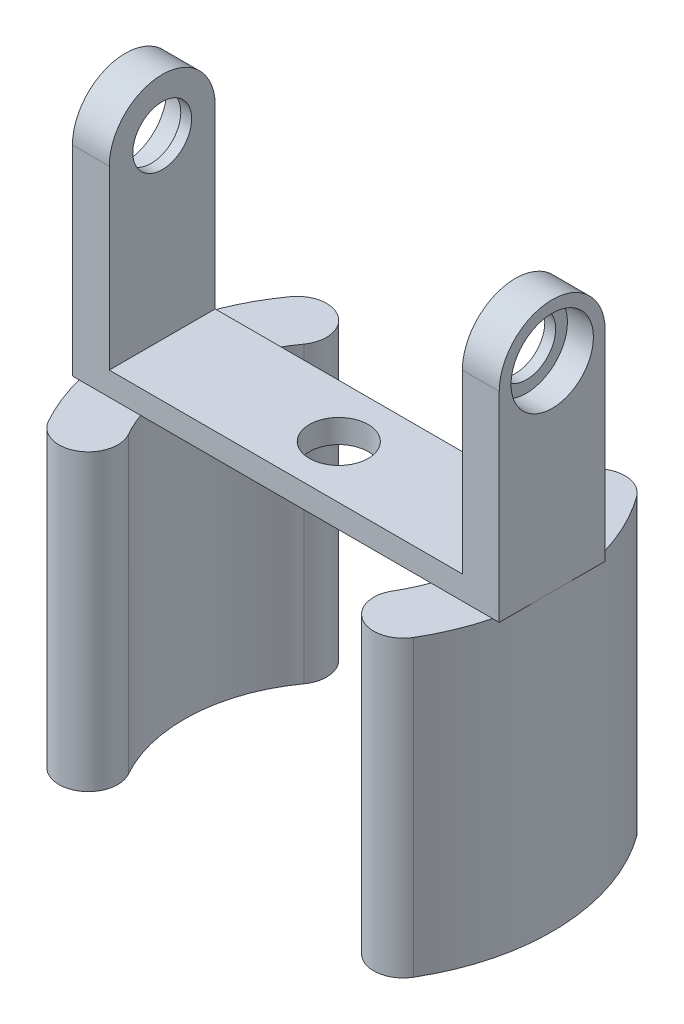
ISO-10303-21;
HEADER;
FILE_DESCRIPTION(('STEP AP214'),'2;1');
FILE_NAME('part.step','',(''),(''),'','','');
FILE_SCHEMA(('AUTOMOTIVE_DESIGN { 1 0 10303 214 1 1 1 1 }'));
ENDSEC;
DATA;
#1=APPLICATION_CONTEXT('core data for automotive mechanical design processes');
#2=APPLICATION_PROTOCOL_DEFINITION('international standard','automotive_design',2000,#1);
#3=PRODUCT_CONTEXT('',#1,'mechanical');
#4=PRODUCT('Part','Part','',(#3));
#5=PRODUCT_RELATED_PRODUCT_CATEGORY('part','',(#4));
#6=PRODUCT_DEFINITION_FORMATION('','',#4);
#7=PRODUCT_DEFINITION_CONTEXT('part definition',#1,'design');
#8=PRODUCT_DEFINITION('design','',#6,#7);
#9=PRODUCT_DEFINITION_SHAPE('','',#8);
#10=(LENGTH_UNIT() NAMED_UNIT(*) SI_UNIT(.MILLI.,.METRE.));
#11=(NAMED_UNIT(*) PLANE_ANGLE_UNIT() SI_UNIT($,.RADIAN.));
#12=(NAMED_UNIT(*) SI_UNIT($,.STERADIAN.) SOLID_ANGLE_UNIT());
#13=UNCERTAINTY_MEASURE_WITH_UNIT(LENGTH_MEASURE(1.E-05),#10,'distance_accuracy_value','');
#14=(GEOMETRIC_REPRESENTATION_CONTEXT(3) GLOBAL_UNCERTAINTY_ASSIGNED_CONTEXT((#13)) GLOBAL_UNIT_ASSIGNED_CONTEXT((#10,
#11,#12)) REPRESENTATION_CONTEXT('',''));
#15=CARTESIAN_POINT('',(0.,0.,0.));
#16=DIRECTION('',(0.,0.,1.));
#17=DIRECTION('',(1.,0.,0.));
#18=AXIS2_PLACEMENT_3D('',#15,#16,#17);
#19=CARTESIAN_POINT('',(0.,-34.,0.));
#20=DIRECTION('',(0.,1.,0.));
#21=DIRECTION('',(0.,0.,1.));
#22=AXIS2_PLACEMENT_3D('',#19,#20,#21);
#23=PLANE('',#22);
#24=CARTESIAN_POINT('',(-30.,-34.,0.));
#25=DIRECTION('',(0.,-1.,0.));
#26=DIRECTION('',(0.,0.,-1.));
#27=AXIS2_PLACEMENT_3D('',#24,#25,#26);
#28=CIRCLE('',#27,36.26);
#29=CARTESIAN_POINT('',(-65.125312809995,-34.,9.));
#30=VERTEX_POINT('',#29);
#31=CARTESIAN_POINT('',(-66.26,-34.,0.));
#32=VERTEX_POINT('',#31);
#33=EDGE_CURVE('E50',#30,#32,#28,.T.);
#34=ORIENTED_EDGE('',*,*,#33,.F.);
#35=DIRECTION('',(-1.,0.,0.));
#36=VECTOR('',#35,1.);
#37=CARTESIAN_POINT('',(6.26,-34.,9.));
#38=LINE('',#37,#36);
#39=CARTESIAN_POINT('',(-66.26,-34.,9.00000000000001));
#40=VERTEX_POINT('',#39);
#41=EDGE_CURVE('E299',#30,#40,#38,.T.);
#42=ORIENTED_EDGE('',*,*,#41,.T.);
#43=DIRECTION('',(0.,0.,1.));
#44=VECTOR('',#43,1.);
#45=CARTESIAN_POINT('',(-66.26,-34.,9.00000000000001));
#46=LINE('',#45,#44);
#47=EDGE_CURVE('E252',#32,#40,#46,.T.);
#48=ORIENTED_EDGE('',*,*,#47,.F.);
#49=EDGE_LOOP('',(#34,#42,#48));
#50=FACE_BOUND('',#49,.T.);
#51=ADVANCED_FACE('F32',(#50),#23,.F.);
#52=CARTESIAN_POINT('',(-65.125312809995,-34.,-9.));
#53=VERTEX_POINT('',#52);
#54=EDGE_CURVE('E386',#32,#53,#28,.T.);
#55=ORIENTED_EDGE('',*,*,#54,.F.);
#56=CARTESIAN_POINT('',(-66.26,-34.,-8.99999999999998));
#57=VERTEX_POINT('',#56);
#58=EDGE_CURVE('E255',#57,#32,#46,.T.);
#59=ORIENTED_EDGE('',*,*,#58,.F.);
#60=DIRECTION('',(1.,0.,0.));
#61=VECTOR('',#60,1.);
#62=CARTESIAN_POINT('',(6.26,-34.,-9.));
#63=LINE('',#62,#61);
#64=EDGE_CURVE('E306',#57,#53,#63,.T.);
#65=ORIENTED_EDGE('',*,*,#64,.T.);
#66=EDGE_LOOP('',(#55,#59,#65));
#67=FACE_BOUND('',#66,.T.);
#68=ADVANCED_FACE('F413',(#67),#23,.F.);
#69=CARTESIAN_POINT('',(-30.,-34.,0.));
#70=DIRECTION('',(0.,1.,0.));
#71=DIRECTION('',(0.,0.,1.));
#72=AXIS2_PLACEMENT_3D('',#69,#70,#71);
#73=CIRCLE('',#72,5.);
#74=CARTESIAN_POINT('',(-30.,-34.,5.00000000000001));
#75=VERTEX_POINT('',#74);
#76=EDGE_CURVE('E249',#75,#75,#73,.T.);
#77=ORIENTED_EDGE('',*,*,#76,.T.);
#78=EDGE_LOOP('',(#77));
#79=FACE_BOUND('',#78,.T.);
#80=CARTESIAN_POINT('',(-30.,-34.,0.));
#81=DIRECTION('',(0.,1.,0.));
#82=DIRECTION('',(0.,0.,-1.));
#83=AXIS2_PLACEMENT_3D('',#80,#81,#82);
#84=CIRCLE('',#83,26.26);
#85=CARTESIAN_POINT('',(-54.6695682978037,-34.,-8.99999999999999));
#86=VERTEX_POINT('',#85);
#87=CARTESIAN_POINT('',(-54.6695682978037,-34.,9.));
#88=VERTEX_POINT('',#87);
#89=EDGE_CURVE('E398',#86,#88,#84,.T.);
#90=ORIENTED_EDGE('',*,*,#89,.F.);
#91=CARTESIAN_POINT('',(-5.33043170219634,-34.,-9.));
#92=VERTEX_POINT('',#91);
#93=EDGE_CURVE('E310',#86,#92,#63,.T.);
#94=ORIENTED_EDGE('',*,*,#93,.T.);
#95=CARTESIAN_POINT('',(-30.,-34.,0.));
#96=DIRECTION('',(0.,1.,0.));
#97=DIRECTION('',(0.,0.,1.));
#98=AXIS2_PLACEMENT_3D('',#95,#96,#97);
#99=CIRCLE('',#98,26.26);
#100=CARTESIAN_POINT('',(-5.33043170219633,-34.,8.99999999999999));
#101=VERTEX_POINT('',#100);
#102=EDGE_CURVE('E234',#101,#92,#99,.T.);
#103=ORIENTED_EDGE('',*,*,#102,.F.);
#104=EDGE_CURVE('E414',#101,#88,#38,.T.);
#105=ORIENTED_EDGE('',*,*,#104,.T.);
#106=EDGE_LOOP('',(#90,#94,#103,#105));
#107=FACE_BOUND('',#106,.T.);
#108=ADVANCED_FACE('F450',(#79,#107),#23,.F.);
#109=CARTESIAN_POINT('',(-30.,-34.,0.));
#110=DIRECTION('',(0.,-1.,0.));
#111=DIRECTION('',(0.,0.,1.));
#112=AXIS2_PLACEMENT_3D('',#109,#110,#111);
#113=CIRCLE('',#112,36.26);
#114=CARTESIAN_POINT('',(5.12531280999501,-34.,-9.));
#115=VERTEX_POINT('',#114);
#116=CARTESIAN_POINT('',(6.25999999999999,-34.,0.));
#117=VERTEX_POINT('',#116);
#118=EDGE_CURVE('E11',#115,#117,#113,.T.);
#119=ORIENTED_EDGE('',*,*,#118,.F.);
#120=CARTESIAN_POINT('',(6.26,-34.,-9.));
#121=VERTEX_POINT('',#120);
#122=EDGE_CURVE('E304',#115,#121,#63,.T.);
#123=ORIENTED_EDGE('',*,*,#122,.T.);
#124=DIRECTION('',(0.,0.,1.));
#125=VECTOR('',#124,1.);
#126=CARTESIAN_POINT('',(6.26,-34.,9.));
#127=LINE('',#126,#125);
#128=EDGE_CURVE('E296',#121,#117,#127,.T.);
#129=ORIENTED_EDGE('',*,*,#128,.T.);
#130=EDGE_LOOP('',(#119,#123,#129));
#131=FACE_BOUND('',#130,.T.);
#132=ADVANCED_FACE('F447',(#131),#23,.F.);
#133=CARTESIAN_POINT('',(5.12531280999501,-34.,8.99999999999999));
#134=VERTEX_POINT('',#133);
#135=EDGE_CURVE('E41',#117,#134,#113,.T.);
#136=ORIENTED_EDGE('',*,*,#135,.F.);
#137=CARTESIAN_POINT('',(6.26,-34.,9.));
#138=VERTEX_POINT('',#137);
#139=EDGE_CURVE('E300',#117,#138,#127,.T.);
#140=ORIENTED_EDGE('',*,*,#139,.T.);
#141=EDGE_CURVE('E301',#138,#134,#38,.T.);
#142=ORIENTED_EDGE('',*,*,#141,.T.);
#143=EDGE_LOOP('',(#136,#140,#142));
#144=FACE_BOUND('',#143,.T.);
#145=ADVANCED_FACE('F449',(#144),#23,.F.);
#146=CARTESIAN_POINT('',(6.26,0.,0.));
#147=DIRECTION('',(-1.,0.,0.));
#148=DIRECTION('',(0.,0.,1.));
#149=AXIS2_PLACEMENT_3D('',#146,#147,#148);
#150=CYLINDRICAL_SURFACE('',#149,5.);
#151=CARTESIAN_POINT('',(0.,0.,0.));
#152=DIRECTION('',(1.,0.,0.));
#153=DIRECTION('',(0.,0.,-1.));
#154=AXIS2_PLACEMENT_3D('',#151,#152,#153);
#155=CIRCLE('',#154,5.);
#156=CARTESIAN_POINT('',(0.,0.,-5.));
#157=VERTEX_POINT('',#156);
#158=EDGE_CURVE('E336',#157,#157,#155,.T.);
#159=ORIENTED_EDGE('',*,*,#158,.F.);
#160=EDGE_LOOP('',(#159));
#161=FACE_BOUND('',#160,.T.);
#162=CARTESIAN_POINT('',(1.85,0.,0.));
#163=DIRECTION('',(1.,0.,0.));
#164=DIRECTION('',(0.,0.,-1.));
#165=AXIS2_PLACEMENT_3D('',#162,#163,#164);
#166=CIRCLE('',#165,5.);
#167=CARTESIAN_POINT('',(1.85,0.,-5.));
#168=VERTEX_POINT('',#167);
#169=EDGE_CURVE('E36',#168,#168,#166,.T.);
#170=ORIENTED_EDGE('',*,*,#169,.T.);
#171=EDGE_LOOP('',(#170));
#172=FACE_BOUND('',#171,.T.);
#173=ADVANCED_FACE('F456',(#161,#172),#150,.F.);
#174=CARTESIAN_POINT('',(6.26,0.,0.));
#175=DIRECTION('',(1.,0.,0.));
#176=DIRECTION('',(0.,0.,-1.));
#177=AXIS2_PLACEMENT_3D('',#174,#175,#176);
#178=PLANE('',#177);
#179=CARTESIAN_POINT('',(6.26,0.,0.));
#180=DIRECTION('',(1.,0.,0.));
#181=DIRECTION('',(0.,0.,-1.));
#182=AXIS2_PLACEMENT_3D('',#179,#180,#181);
#183=CIRCLE('',#182,7.);
#184=CARTESIAN_POINT('',(6.26,0.,-7.));
#185=VERTEX_POINT('',#184);
#186=EDGE_CURVE('E309',#185,#185,#183,.T.);
#187=ORIENTED_EDGE('',*,*,#186,.F.);
#188=EDGE_LOOP('',(#187));
#189=FACE_BOUND('',#188,.T.);
#190=CARTESIAN_POINT('',(6.26,0.,0.));
#191=DIRECTION('',(1.,0.,0.));
#192=DIRECTION('',(0.,0.,-1.));
#193=AXIS2_PLACEMENT_3D('',#190,#191,#192);
#194=CIRCLE('',#193,9.);
#195=CARTESIAN_POINT('',(6.26,0.,-9.));
#196=VERTEX_POINT('',#195);
#197=CARTESIAN_POINT('',(6.26,0.,9.));
#198=VERTEX_POINT('',#197);
#199=EDGE_CURVE('E344',#196,#198,#194,.T.);
#200=ORIENTED_EDGE('',*,*,#199,.T.);
#201=DIRECTION('',(0.,1.,0.));
#202=VECTOR('',#201,1.);
#203=CARTESIAN_POINT('',(6.26,-30.,9.));
#204=LINE('',#203,#202);
#205=EDGE_CURVE('E324',#138,#198,#204,.T.);
#206=ORIENTED_EDGE('',*,*,#205,.F.);
#207=ORIENTED_EDGE('',*,*,#139,.F.);
#208=ORIENTED_EDGE('',*,*,#128,.F.);
#209=DIRECTION('',(0.,-1.,0.));
#210=VECTOR('',#209,1.);
#211=CARTESIAN_POINT('',(6.26,0.,-9.));
#212=LINE('',#211,#210);
#213=EDGE_CURVE('E333',#196,#121,#212,.T.);
#214=ORIENTED_EDGE('',*,*,#213,.F.);
#215=EDGE_LOOP('',(#200,#206,#207,#208,#214));
#216=FACE_BOUND('',#215,.T.);
#217=ADVANCED_FACE('F361',(#189,#216),#178,.T.);
#218=CARTESIAN_POINT('',(0.,0.,0.));
#219=DIRECTION('',(1.,0.,0.));
#220=DIRECTION('',(0.,0.,-1.));
#221=AXIS2_PLACEMENT_3D('',#218,#219,#220);
#222=PLANE('',#221);
#223=DIRECTION('',(0.,1.,0.));
#224=VECTOR('',#223,1.);
#225=CARTESIAN_POINT('',(0.,-30.,9.));
#226=LINE('',#225,#224);
#227=CARTESIAN_POINT('',(0.,-30.,9.));
#228=VERTEX_POINT('',#227);
#229=CARTESIAN_POINT('',(0.,0.,9.));
#230=VERTEX_POINT('',#229);
#231=EDGE_CURVE('E325',#228,#230,#226,.T.);
#232=ORIENTED_EDGE('',*,*,#231,.T.);
#233=CARTESIAN_POINT('',(0.,0.,0.));
#234=DIRECTION('',(1.,0.,0.));
#235=DIRECTION('',(0.,0.,-1.));
#236=AXIS2_PLACEMENT_3D('',#233,#234,#235);
#237=CIRCLE('',#236,9.);
#238=CARTESIAN_POINT('',(0.,0.,-9.));
#239=VERTEX_POINT('',#238);
#240=EDGE_CURVE('E343',#239,#230,#237,.T.);
#241=ORIENTED_EDGE('',*,*,#240,.F.);
#242=DIRECTION('',(0.,-1.,0.));
#243=VECTOR('',#242,1.);
#244=CARTESIAN_POINT('',(0.,0.,-9.));
#245=LINE('',#244,#243);
#246=CARTESIAN_POINT('',(0.,-30.,-9.));
#247=VERTEX_POINT('',#246);
#248=EDGE_CURVE('E321',#239,#247,#245,.T.);
#249=ORIENTED_EDGE('',*,*,#248,.T.);
#250=DIRECTION('',(0.,0.,1.));
#251=VECTOR('',#250,1.);
#252=CARTESIAN_POINT('',(0.,-30.,-8.99999999999999));
#253=LINE('',#252,#251);
#254=EDGE_CURVE('E328',#247,#228,#253,.T.);
#255=ORIENTED_EDGE('',*,*,#254,.T.);
#256=EDGE_LOOP('',(#232,#241,#249,#255));
#257=FACE_BOUND('',#256,.T.);
#258=ORIENTED_EDGE('',*,*,#158,.T.);
#259=EDGE_LOOP('',(#258));
#260=FACE_BOUND('',#259,.T.);
#261=ADVANCED_FACE('F353',(#257,#260),#222,.F.);
#262=CARTESIAN_POINT('',(6.26,0.,0.));
#263=DIRECTION('',(-1.,0.,0.));
#264=DIRECTION('',(0.,0.,1.));
#265=AXIS2_PLACEMENT_3D('',#262,#263,#264);
#266=CYLINDRICAL_SURFACE('',#265,9.);
#267=ORIENTED_EDGE('',*,*,#240,.T.);
#268=DIRECTION('',(-1.,0.,0.));
#269=VECTOR('',#268,1.);
#270=CARTESIAN_POINT('',(41.2457113690718,0.,9.));
#271=LINE('',#270,#269);
#272=EDGE_CURVE('E332',#198,#230,#271,.T.);
#273=ORIENTED_EDGE('',*,*,#272,.F.);
#274=ORIENTED_EDGE('',*,*,#199,.F.);
#275=DIRECTION('',(-1.,0.,0.));
#276=VECTOR('',#275,1.);
#277=CARTESIAN_POINT('',(41.2457113690718,0.,-9.));
#278=LINE('',#277,#276);
#279=EDGE_CURVE('E337',#196,#239,#278,.T.);
#280=ORIENTED_EDGE('',*,*,#279,.T.);
#281=EDGE_LOOP('',(#267,#273,#274,#280));
#282=FACE_BOUND('',#281,.T.);
#283=ADVANCED_FACE('F34',(#282),#266,.T.);
#284=CARTESIAN_POINT('',(41.2457113690718,-30.,9.));
#285=DIRECTION('',(0.,0.,1.));
#286=DIRECTION('',(0.,-1.,0.));
#287=AXIS2_PLACEMENT_3D('',#284,#285,#286);
#288=PLANE('',#287);
#289=ORIENTED_EDGE('',*,*,#231,.F.);
#290=DIRECTION('',(-1.,0.,0.));
#291=VECTOR('',#290,1.);
#292=CARTESIAN_POINT('',(6.26,-30.,9.));
#293=LINE('',#292,#291);
#294=CARTESIAN_POINT('',(-60.,-30.,9.00000000000001));
#295=VERTEX_POINT('',#294);
#296=EDGE_CURVE('E291',#228,#295,#293,.T.);
#297=ORIENTED_EDGE('',*,*,#296,.T.);
#298=DIRECTION('',(0.,1.,0.));
#299=VECTOR('',#298,1.);
#300=CARTESIAN_POINT('',(-60.,-30.,9.00000000000001));
#301=LINE('',#300,#299);
#302=CARTESIAN_POINT('',(-60.,0.,9.00000000000001));
#303=VERTEX_POINT('',#302);
#304=EDGE_CURVE('E269',#295,#303,#301,.T.);
#305=ORIENTED_EDGE('',*,*,#304,.T.);
#306=DIRECTION('',(1.,0.,0.));
#307=VECTOR('',#306,1.);
#308=CARTESIAN_POINT('',(-101.245711369072,0.,9.00000000000003));
#309=LINE('',#308,#307);
#310=CARTESIAN_POINT('',(-66.26,0.,9.00000000000001));
#311=VERTEX_POINT('',#310);
#312=EDGE_CURVE('E277',#311,#303,#309,.T.);
#313=ORIENTED_EDGE('',*,*,#312,.F.);
#314=DIRECTION('',(0.,1.,0.));
#315=VECTOR('',#314,1.);
#316=CARTESIAN_POINT('',(-66.26,-30.,9.00000000000001));
#317=LINE('',#316,#315);
#318=EDGE_CURVE('E268',#40,#311,#317,.T.);
#319=ORIENTED_EDGE('',*,*,#318,.F.);
#320=ORIENTED_EDGE('',*,*,#41,.F.);
#321=DIRECTION('',(-1.,0.,0.));
#322=VECTOR('',#321,1.);
#323=CARTESIAN_POINT('',(41.2457113690718,-34.,9.));
#324=LINE('',#323,#322);
#325=EDGE_CURVE('E57',#88,#30,#324,.T.);
#326=ORIENTED_EDGE('',*,*,#325,.F.);
#327=ORIENTED_EDGE('',*,*,#104,.F.);
#328=EDGE_CURVE('E305',#134,#101,#38,.T.);
#329=ORIENTED_EDGE('',*,*,#328,.F.);
#330=ORIENTED_EDGE('',*,*,#141,.F.);
#331=ORIENTED_EDGE('',*,*,#205,.T.);
#332=ORIENTED_EDGE('',*,*,#272,.T.);
#333=EDGE_LOOP('',(#289,#297,#305,#313,#319,#320,#326,#327,#329,#330,#331,#332));
#334=FACE_BOUND('',#333,.T.);
#335=ADVANCED_FACE('F356',(#334),#288,.T.);
#336=CARTESIAN_POINT('',(41.2457113690718,0.,-9.));
#337=DIRECTION('',(0.,0.,-1.));
#338=DIRECTION('',(0.,1.,0.));
#339=AXIS2_PLACEMENT_3D('',#336,#337,#338);
#340=PLANE('',#339);
#341=ORIENTED_EDGE('',*,*,#279,.F.);
#342=ORIENTED_EDGE('',*,*,#213,.T.);
#343=ORIENTED_EDGE('',*,*,#122,.F.);
#344=EDGE_CURVE('E311',#92,#115,#63,.T.);
#345=ORIENTED_EDGE('',*,*,#344,.F.);
#346=ORIENTED_EDGE('',*,*,#93,.F.);
#347=DIRECTION('',(1.,0.,0.));
#348=VECTOR('',#347,1.);
#349=CARTESIAN_POINT('',(41.2457113690718,-34.,-8.99999999999999));
#350=LINE('',#349,#348);
#351=EDGE_CURVE('E206',#53,#86,#350,.T.);
#352=ORIENTED_EDGE('',*,*,#351,.F.);
#353=ORIENTED_EDGE('',*,*,#64,.F.);
#354=DIRECTION('',(0.,-1.,0.));
#355=VECTOR('',#354,1.);
#356=CARTESIAN_POINT('',(-66.26,0.,-8.99999999999999));
#357=LINE('',#356,#355);
#358=CARTESIAN_POINT('',(-66.26,0.,-8.99999999999999));
#359=VERTEX_POINT('',#358);
#360=EDGE_CURVE('E278',#359,#57,#357,.T.);
#361=ORIENTED_EDGE('',*,*,#360,.F.);
#362=DIRECTION('',(1.,0.,0.));
#363=VECTOR('',#362,1.);
#364=CARTESIAN_POINT('',(-101.245711369072,0.,-8.99999999999997));
#365=LINE('',#364,#363);
#366=CARTESIAN_POINT('',(-60.,0.,-8.99999999999999));
#367=VERTEX_POINT('',#366);
#368=EDGE_CURVE('E282',#359,#367,#365,.T.);
#369=ORIENTED_EDGE('',*,*,#368,.T.);
#370=DIRECTION('',(0.,-1.,0.));
#371=VECTOR('',#370,1.);
#372=CARTESIAN_POINT('',(-60.,0.,-8.99999999999999));
#373=LINE('',#372,#371);
#374=CARTESIAN_POINT('',(-60.,-30.,-8.99999999999998));
#375=VERTEX_POINT('',#374);
#376=EDGE_CURVE('E265',#367,#375,#373,.T.);
#377=ORIENTED_EDGE('',*,*,#376,.T.);
#378=DIRECTION('',(1.,0.,0.));
#379=VECTOR('',#378,1.);
#380=CARTESIAN_POINT('',(6.26,-30.,-9.));
#381=LINE('',#380,#379);
#382=EDGE_CURVE('E313',#375,#247,#381,.T.);
#383=ORIENTED_EDGE('',*,*,#382,.T.);
#384=ORIENTED_EDGE('',*,*,#248,.F.);
#385=EDGE_LOOP('',(#341,#342,#343,#345,#346,#352,#353,#361,#369,#377,#383,#384));
#386=FACE_BOUND('',#385,.T.);
#387=ADVANCED_FACE('F365',(#386),#340,.T.);
#388=CARTESIAN_POINT('',(1.85,0.,0.));
#389=DIRECTION('',(1.,0.,0.));
#390=DIRECTION('',(0.,0.,-1.));
#391=AXIS2_PLACEMENT_3D('',#388,#389,#390);
#392=CYLINDRICAL_SURFACE('',#391,7.);
#393=CARTESIAN_POINT('',(1.85,0.,0.));
#394=DIRECTION('',(1.,0.,0.));
#395=DIRECTION('',(0.,0.,-1.));
#396=AXIS2_PLACEMENT_3D('',#393,#394,#395);
#397=CIRCLE('',#396,7.);
#398=CARTESIAN_POINT('',(1.85,0.,-7.));
#399=VERTEX_POINT('',#398);
#400=EDGE_CURVE('E316',#399,#399,#397,.T.);
#401=ORIENTED_EDGE('',*,*,#400,.F.);
#402=EDGE_LOOP('',(#401));
#403=FACE_BOUND('',#402,.T.);
#404=ORIENTED_EDGE('',*,*,#186,.T.);
#405=EDGE_LOOP('',(#404));
#406=FACE_BOUND('',#405,.T.);
#407=ADVANCED_FACE('F517',(#403,#406),#392,.F.);
#408=CARTESIAN_POINT('',(1.85,0.,0.));
#409=DIRECTION('',(1.,0.,0.));
#410=DIRECTION('',(0.,0.,-1.));
#411=AXIS2_PLACEMENT_3D('',#408,#409,#410);
#412=PLANE('',#411);
#413=ORIENTED_EDGE('',*,*,#169,.F.);
#414=EDGE_LOOP('',(#413));
#415=FACE_BOUND('',#414,.T.);
#416=ORIENTED_EDGE('',*,*,#400,.T.);
#417=EDGE_LOOP('',(#416));
#418=FACE_BOUND('',#417,.T.);
#419=ADVANCED_FACE('F702',(#415,#418),#412,.T.);
#420=CARTESIAN_POINT('',(0.,-30.,0.));
#421=DIRECTION('',(0.,1.,0.));
#422=DIRECTION('',(0.,0.,1.));
#423=AXIS2_PLACEMENT_3D('',#420,#421,#422);
#424=PLANE('',#423);
#425=CARTESIAN_POINT('',(-30.,-30.,0.));
#426=DIRECTION('',(0.,1.,0.));
#427=DIRECTION('',(0.,0.,1.));
#428=AXIS2_PLACEMENT_3D('',#425,#426,#427);
#429=CIRCLE('',#428,5.);
#430=CARTESIAN_POINT('',(-30.,-30.,5.00000000000001));
#431=VERTEX_POINT('',#430);
#432=EDGE_CURVE('E248',#431,#431,#429,.T.);
#433=ORIENTED_EDGE('',*,*,#432,.F.);
#434=EDGE_LOOP('',(#433));
#435=FACE_BOUND('',#434,.T.);
#436=ORIENTED_EDGE('',*,*,#254,.F.);
#437=ORIENTED_EDGE('',*,*,#382,.F.);
#438=DIRECTION('',(0.,0.,1.));
#439=VECTOR('',#438,1.);
#440=CARTESIAN_POINT('',(-60.,-30.,-8.99999999999998));
#441=LINE('',#440,#439);
#442=EDGE_CURVE('E272',#375,#295,#441,.T.);
#443=ORIENTED_EDGE('',*,*,#442,.T.);
#444=ORIENTED_EDGE('',*,*,#296,.F.);
#445=EDGE_LOOP('',(#436,#437,#443,#444));
#446=FACE_BOUND('',#445,.T.);
#447=ADVANCED_FACE('F369',(#435,#446),#424,.T.);
#448=CARTESIAN_POINT('',(-66.26,0.,0.));
#449=DIRECTION('',(1.,0.,0.));
#450=DIRECTION('',(0.,0.,1.));
#451=AXIS2_PLACEMENT_3D('',#448,#449,#450);
#452=CYLINDRICAL_SURFACE('',#451,5.);
#453=CARTESIAN_POINT('',(-60.,0.,0.));
#454=DIRECTION('',(1.,0.,0.));
#455=DIRECTION('',(0.,0.,-1.));
#456=AXIS2_PLACEMENT_3D('',#453,#454,#455);
#457=CIRCLE('',#456,5.);
#458=CARTESIAN_POINT('',(-60.,0.,-4.99999999999999));
#459=VERTEX_POINT('',#458);
#460=EDGE_CURVE('E281',#459,#459,#457,.T.);
#461=ORIENTED_EDGE('',*,*,#460,.T.);
#462=EDGE_LOOP('',(#461));
#463=FACE_BOUND('',#462,.T.);
#464=CARTESIAN_POINT('',(-61.85,0.,0.));
#465=DIRECTION('',(1.,0.,0.));
#466=DIRECTION('',(0.,0.,-1.));
#467=AXIS2_PLACEMENT_3D('',#464,#465,#466);
#468=CIRCLE('',#467,5.);
#469=CARTESIAN_POINT('',(-61.85,0.,-4.99999999999999));
#470=VERTEX_POINT('',#469);
#471=EDGE_CURVE('E262',#470,#470,#468,.T.);
#472=ORIENTED_EDGE('',*,*,#471,.F.);
#473=EDGE_LOOP('',(#472));
#474=FACE_BOUND('',#473,.T.);
#475=ADVANCED_FACE('F528',(#463,#474),#452,.F.);
#476=CARTESIAN_POINT('',(-66.26,0.,0.));
#477=DIRECTION('',(-1.,0.,0.));
#478=DIRECTION('',(0.,0.,-1.));
#479=AXIS2_PLACEMENT_3D('',#476,#477,#478);
#480=PLANE('',#479);
#481=CARTESIAN_POINT('',(-66.26,0.,0.));
#482=DIRECTION('',(1.,0.,0.));
#483=DIRECTION('',(0.,0.,-1.));
#484=AXIS2_PLACEMENT_3D('',#481,#482,#483);
#485=CIRCLE('',#484,7.);
#486=CARTESIAN_POINT('',(-66.26,0.,-6.99999999999999));
#487=VERTEX_POINT('',#486);
#488=EDGE_CURVE('E258',#487,#487,#485,.T.);
#489=ORIENTED_EDGE('',*,*,#488,.T.);
#490=EDGE_LOOP('',(#489));
#491=FACE_BOUND('',#490,.T.);
#492=CARTESIAN_POINT('',(-66.26,0.,0.));
#493=DIRECTION('',(1.,0.,0.));
#494=DIRECTION('',(0.,0.,-1.));
#495=AXIS2_PLACEMENT_3D('',#492,#493,#494);
#496=CIRCLE('',#495,9.);
#497=EDGE_CURVE('E288',#359,#311,#496,.T.);
#498=ORIENTED_EDGE('',*,*,#497,.F.);
#499=ORIENTED_EDGE('',*,*,#360,.T.);
#500=ORIENTED_EDGE('',*,*,#58,.T.);
#501=ORIENTED_EDGE('',*,*,#47,.T.);
#502=ORIENTED_EDGE('',*,*,#318,.T.);
#503=EDGE_LOOP('',(#498,#499,#500,#501,#502));
#504=FACE_BOUND('',#503,.T.);
#505=ADVANCED_FACE('F380',(#491,#504),#480,.T.);
#506=CARTESIAN_POINT('',(-60.,0.,0.));
#507=DIRECTION('',(-1.,0.,0.));
#508=DIRECTION('',(0.,0.,-1.));
#509=AXIS2_PLACEMENT_3D('',#506,#507,#508);
#510=PLANE('',#509);
#511=ORIENTED_EDGE('',*,*,#304,.F.);
#512=ORIENTED_EDGE('',*,*,#442,.F.);
#513=ORIENTED_EDGE('',*,*,#376,.F.);
#514=CARTESIAN_POINT('',(-60.,0.,0.));
#515=DIRECTION('',(1.,0.,0.));
#516=DIRECTION('',(0.,0.,-1.));
#517=AXIS2_PLACEMENT_3D('',#514,#515,#516);
#518=CIRCLE('',#517,9.);
#519=EDGE_CURVE('E287',#367,#303,#518,.T.);
#520=ORIENTED_EDGE('',*,*,#519,.T.);
#521=EDGE_LOOP('',(#511,#512,#513,#520));
#522=FACE_BOUND('',#521,.T.);
#523=ORIENTED_EDGE('',*,*,#460,.F.);
#524=EDGE_LOOP('',(#523));
#525=FACE_BOUND('',#524,.T.);
#526=ADVANCED_FACE('F372',(#522,#525),#510,.F.);
#527=CARTESIAN_POINT('',(-66.26,0.,0.));
#528=DIRECTION('',(1.,0.,0.));
#529=DIRECTION('',(0.,0.,1.));
#530=AXIS2_PLACEMENT_3D('',#527,#528,#529);
#531=CYLINDRICAL_SURFACE('',#530,9.);
#532=ORIENTED_EDGE('',*,*,#519,.F.);
#533=ORIENTED_EDGE('',*,*,#368,.F.);
#534=ORIENTED_EDGE('',*,*,#497,.T.);
#535=ORIENTED_EDGE('',*,*,#312,.T.);
#536=EDGE_LOOP('',(#532,#533,#534,#535));
#537=FACE_BOUND('',#536,.T.);
#538=ADVANCED_FACE('F381',(#537),#531,.T.);
#539=CARTESIAN_POINT('',(-61.85,0.,0.));
#540=DIRECTION('',(-1.,0.,0.));
#541=DIRECTION('',(0.,0.,-1.));
#542=AXIS2_PLACEMENT_3D('',#539,#540,#541);
#543=CYLINDRICAL_SURFACE('',#542,7.);
#544=CARTESIAN_POINT('',(-61.85,0.,0.));
#545=DIRECTION('',(1.,0.,0.));
#546=DIRECTION('',(0.,0.,-1.));
#547=AXIS2_PLACEMENT_3D('',#544,#545,#546);
#548=CIRCLE('',#547,7.);
#549=CARTESIAN_POINT('',(-61.85,0.,-6.99999999999999));
#550=VERTEX_POINT('',#549);
#551=EDGE_CURVE('E259',#550,#550,#548,.T.);
#552=ORIENTED_EDGE('',*,*,#551,.T.);
#553=EDGE_LOOP('',(#552));
#554=FACE_BOUND('',#553,.T.);
#555=ORIENTED_EDGE('',*,*,#488,.F.);
#556=EDGE_LOOP('',(#555));
#557=FACE_BOUND('',#556,.T.);
#558=ADVANCED_FACE('F661',(#554,#557),#543,.F.);
#559=CARTESIAN_POINT('',(-61.85,0.,0.));
#560=DIRECTION('',(-1.,0.,0.));
#561=DIRECTION('',(0.,0.,-1.));
#562=AXIS2_PLACEMENT_3D('',#559,#560,#561);
#563=PLANE('',#562);
#564=ORIENTED_EDGE('',*,*,#471,.T.);
#565=EDGE_LOOP('',(#564));
#566=FACE_BOUND('',#565,.T.);
#567=ORIENTED_EDGE('',*,*,#551,.F.);
#568=EDGE_LOOP('',(#567));
#569=FACE_BOUND('',#568,.T.);
#570=ADVANCED_FACE('F657',(#566,#569),#563,.T.);
#571=CARTESIAN_POINT('',(-30.,-34.,0.));
#572=DIRECTION('',(0.,1.,0.));
#573=DIRECTION('',(0.,0.,1.));
#574=AXIS2_PLACEMENT_3D('',#571,#572,#573);
#575=CYLINDRICAL_SURFACE('',#574,5.);
#576=ORIENTED_EDGE('',*,*,#76,.F.);
#577=EDGE_LOOP('',(#576));
#578=FACE_BOUND('',#577,.T.);
#579=ORIENTED_EDGE('',*,*,#432,.T.);
#580=EDGE_LOOP('',(#579));
#581=FACE_BOUND('',#580,.T.);
#582=ADVANCED_FACE('F542',(#578,#581),#575,.F.);
#583=CARTESIAN_POINT('',(-16.5577206993728,-34.,7.9750879119876));
#584=DIRECTION('',(0.,-1.,0.));
#585=DIRECTION('',(0.,0.,-1.));
#586=AXIS2_PLACEMENT_3D('',#583,#584,#585);
#587=PLANE('',#586);
#588=CARTESIAN_POINT('',(1.18471192839032,-34.,18.5013875680531));
#589=VERTEX_POINT('',#588);
#590=EDGE_CURVE('E43',#134,#589,#113,.T.);
#591=ORIENTED_EDGE('',*,*,#590,.F.);
#592=ORIENTED_EDGE('',*,*,#328,.T.);
#593=CARTESIAN_POINT('',(-7.41559472588169,-34.,13.3989640798973));
#594=VERTEX_POINT('',#593);
#595=EDGE_CURVE('E230',#594,#101,#99,.T.);
#596=ORIENTED_EDGE('',*,*,#595,.F.);
#597=CARTESIAN_POINT('',(-3.11544139874569,-34.,15.9501758239752));
#598=DIRECTION('',(0.,-1.,0.));
#599=DIRECTION('',(0.,0.,-1.));
#600=AXIS2_PLACEMENT_3D('',#597,#598,#599);
#601=CIRCLE('',#600,5.);
#602=EDGE_CURVE('E215',#589,#594,#601,.T.);
#603=ORIENTED_EDGE('',*,*,#602,.F.);
#604=EDGE_LOOP('',(#591,#592,#596,#603));
#605=FACE_BOUND('',#604,.T.);
#606=ADVANCED_FACE('F420',(#605),#587,.F.);
#607=CARTESIAN_POINT('',(-8.69775080690011,-34.,-15.3558386067018));
#608=VERTEX_POINT('',#607);
#609=EDGE_CURVE('E229',#92,#608,#99,.T.);
#610=ORIENTED_EDGE('',*,*,#609,.F.);
#611=ORIENTED_EDGE('',*,*,#344,.T.);
#612=CARTESIAN_POINT('',(-0.585698562764581,-34.,-21.2034542223537));
#613=VERTEX_POINT('',#612);
#614=EDGE_CURVE('E220',#613,#115,#113,.T.);
#615=ORIENTED_EDGE('',*,*,#614,.F.);
#616=CARTESIAN_POINT('',(-4.64172468483234,-34.,-18.2796464145278));
#617=DIRECTION('',(0.,-1.,0.));
#618=DIRECTION('',(0.,0.,1.));
#619=AXIS2_PLACEMENT_3D('',#616,#617,#618);
#620=CIRCLE('',#619,5.);
#621=EDGE_CURVE('E233',#608,#613,#620,.T.);
#622=ORIENTED_EDGE('',*,*,#621,.F.);
#623=EDGE_LOOP('',(#610,#611,#615,#622));
#624=FACE_BOUND('',#623,.T.);
#625=ADVANCED_FACE('F445',(#624),#587,.F.);
#626=CARTESIAN_POINT('',(-3.11544139874569,-84.,15.9501758239752));
#627=DIRECTION('',(0.,1.,0.));
#628=DIRECTION('',(0.,0.,1.));
#629=AXIS2_PLACEMENT_3D('',#626,#627,#628);
#630=CYLINDRICAL_SURFACE('',#629,5.);
#631=ORIENTED_EDGE('',*,*,#602,.T.);
#632=DIRECTION('',(0.,1.,0.));
#633=VECTOR('',#632,1.);
#634=CARTESIAN_POINT('',(-7.41559472588169,-84.,13.3989640798973));
#635=LINE('',#634,#633);
#636=CARTESIAN_POINT('',(-7.41559472588169,-84.,13.3989640798973));
#637=VERTEX_POINT('',#636);
#638=EDGE_CURVE('E245',#637,#594,#635,.T.);
#639=ORIENTED_EDGE('',*,*,#638,.F.);
#640=CARTESIAN_POINT('',(-3.11544139874569,-84.,15.9501758239752));
#641=DIRECTION('',(0.,-1.,0.));
#642=DIRECTION('',(0.,0.,-1.));
#643=AXIS2_PLACEMENT_3D('',#640,#641,#642);
#644=CIRCLE('',#643,5.);
#645=CARTESIAN_POINT('',(1.18471192839032,-84.,18.5013875680531));
#646=VERTEX_POINT('',#645);
#647=EDGE_CURVE('E216',#646,#637,#644,.T.);
#648=ORIENTED_EDGE('',*,*,#647,.F.);
#649=DIRECTION('',(0.,1.,0.));
#650=VECTOR('',#649,1.);
#651=CARTESIAN_POINT('',(1.18471192839032,-84.,18.5013875680531));
#652=LINE('',#651,#650);
#653=EDGE_CURVE('E226',#646,#589,#652,.T.);
#654=ORIENTED_EDGE('',*,*,#653,.T.);
#655=EDGE_LOOP('',(#631,#639,#648,#654));
#656=FACE_BOUND('',#655,.T.);
#657=ADVANCED_FACE('F430',(#656),#630,.T.);
#658=CARTESIAN_POINT('',(-30.,-84.,0.));
#659=DIRECTION('',(0.,1.,0.));
#660=DIRECTION('',(0.,0.,1.));
#661=AXIS2_PLACEMENT_3D('',#658,#659,#660);
#662=CYLINDRICAL_SURFACE('',#661,26.26);
#663=ORIENTED_EDGE('',*,*,#595,.T.);
#664=ORIENTED_EDGE('',*,*,#102,.T.);
#665=ORIENTED_EDGE('',*,*,#609,.T.);
#666=DIRECTION('',(0.,1.,0.));
#667=VECTOR('',#666,1.);
#668=CARTESIAN_POINT('',(-8.69775080690011,-84.,-15.3558386067018));
#669=LINE('',#668,#667);
#670=CARTESIAN_POINT('',(-8.69775080690011,-84.,-15.3558386067018));
#671=VERTEX_POINT('',#670);
#672=EDGE_CURVE('E242',#671,#608,#669,.T.);
#673=ORIENTED_EDGE('',*,*,#672,.F.);
#674=CARTESIAN_POINT('',(-30.,-84.,0.));
#675=DIRECTION('',(0.,1.,0.));
#676=DIRECTION('',(0.,0.,1.));
#677=AXIS2_PLACEMENT_3D('',#674,#675,#676);
#678=CIRCLE('',#677,26.26);
#679=EDGE_CURVE('E219',#637,#671,#678,.T.);
#680=ORIENTED_EDGE('',*,*,#679,.F.);
#681=ORIENTED_EDGE('',*,*,#638,.T.);
#682=EDGE_LOOP('',(#663,#664,#665,#673,#680,#681));
#683=FACE_BOUND('',#682,.T.);
#684=ADVANCED_FACE('F425',(#683),#662,.F.);
#685=CARTESIAN_POINT('',(-4.64172468483234,-84.,-18.2796464145278));
#686=DIRECTION('',(0.,1.,0.));
#687=DIRECTION('',(0.,0.,1.));
#688=AXIS2_PLACEMENT_3D('',#685,#686,#687);
#689=CYLINDRICAL_SURFACE('',#688,5.);
#690=ORIENTED_EDGE('',*,*,#621,.T.);
#691=DIRECTION('',(0.,1.,0.));
#692=VECTOR('',#691,1.);
#693=CARTESIAN_POINT('',(-0.585698562764581,-84.,-21.2034542223537));
#694=LINE('',#693,#692);
#695=CARTESIAN_POINT('',(-0.585698562764581,-84.,-21.2034542223537));
#696=VERTEX_POINT('',#695);
#697=EDGE_CURVE('E239',#696,#613,#694,.T.);
#698=ORIENTED_EDGE('',*,*,#697,.F.);
#699=CARTESIAN_POINT('',(-4.64172468483234,-84.,-18.2796464145278));
#700=DIRECTION('',(0.,-1.,0.));
#701=DIRECTION('',(0.,0.,1.));
#702=AXIS2_PLACEMENT_3D('',#699,#700,#701);
#703=CIRCLE('',#702,5.);
#704=EDGE_CURVE('E222',#671,#696,#703,.T.);
#705=ORIENTED_EDGE('',*,*,#704,.F.);
#706=ORIENTED_EDGE('',*,*,#672,.T.);
#707=EDGE_LOOP('',(#690,#698,#705,#706));
#708=FACE_BOUND('',#707,.T.);
#709=ADVANCED_FACE('F442',(#708),#689,.T.);
#710=CARTESIAN_POINT('',(-30.,-84.,0.));
#711=DIRECTION('',(0.,1.,0.));
#712=DIRECTION('',(0.,0.,1.));
#713=AXIS2_PLACEMENT_3D('',#710,#711,#712);
#714=CYLINDRICAL_SURFACE('',#713,36.26);
#715=ORIENTED_EDGE('',*,*,#614,.T.);
#716=ORIENTED_EDGE('',*,*,#118,.T.);
#717=ORIENTED_EDGE('',*,*,#135,.T.);
#718=ORIENTED_EDGE('',*,*,#590,.T.);
#719=ORIENTED_EDGE('',*,*,#653,.F.);
#720=CARTESIAN_POINT('',(-30.,-84.,0.));
#721=DIRECTION('',(0.,-1.,0.));
#722=DIRECTION('',(0.,0.,1.));
#723=AXIS2_PLACEMENT_3D('',#720,#721,#722);
#724=CIRCLE('',#723,36.26);
#725=EDGE_CURVE('E224',#696,#646,#724,.T.);
#726=ORIENTED_EDGE('',*,*,#725,.F.);
#727=ORIENTED_EDGE('',*,*,#697,.T.);
#728=EDGE_LOOP('',(#715,#716,#717,#718,#719,#726,#727));
#729=FACE_BOUND('',#728,.T.);
#730=ADVANCED_FACE('F434',(#729),#714,.T.);
#731=CARTESIAN_POINT('',(-16.5577206993728,-84.,7.9750879119876));
#732=DIRECTION('',(0.,-1.,0.));
#733=DIRECTION('',(0.,0.,-1.));
#734=AXIS2_PLACEMENT_3D('',#731,#732,#733);
#735=PLANE('',#734);
#736=ORIENTED_EDGE('',*,*,#647,.T.);
#737=ORIENTED_EDGE('',*,*,#679,.T.);
#738=ORIENTED_EDGE('',*,*,#704,.T.);
#739=ORIENTED_EDGE('',*,*,#725,.T.);
#740=EDGE_LOOP('',(#736,#737,#738,#739));
#741=FACE_BOUND('',#740,.T.);
#742=ADVANCED_FACE('F584',(#741),#735,.T.);
#743=CARTESIAN_POINT('',(-43.6379580195978,-34.,7.63564018636865));
#744=DIRECTION('',(0.,1.,0.));
#745=DIRECTION('',(0.,0.,1.));
#746=AXIS2_PLACEMENT_3D('',#743,#744,#745);
#747=PLANE('',#746);
#748=CARTESIAN_POINT('',(-52.9131655530799,-34.,12.8286571525298));
#749=VERTEX_POINT('',#748);
#750=EDGE_CURVE('E395',#88,#749,#84,.T.);
#751=ORIENTED_EDGE('',*,*,#750,.F.);
#752=ORIENTED_EDGE('',*,*,#325,.T.);
#753=CARTESIAN_POINT('',(-61.6386665253114,-34.,17.7139035929448));
#754=VERTEX_POINT('',#753);
#755=EDGE_CURVE('E387',#754,#30,#28,.T.);
#756=ORIENTED_EDGE('',*,*,#755,.F.);
#757=CARTESIAN_POINT('',(-57.2759160391956,-34.,15.2712803727373));
#758=DIRECTION('',(0.,-1.,0.));
#759=DIRECTION('',(0.,0.,1.));
#760=AXIS2_PLACEMENT_3D('',#757,#758,#759);
#761=CIRCLE('',#760,5.);
#762=EDGE_CURVE('E205',#749,#754,#761,.T.);
#763=ORIENTED_EDGE('',*,*,#762,.F.);
#764=EDGE_LOOP('',(#751,#752,#756,#763));
#765=FACE_BOUND('',#764,.T.);
#766=ADVANCED_FACE('F593',(#765),#747,.T.);
#767=CARTESIAN_POINT('',(-57.2759160391956,-84.,15.2712803727373));
#768=DIRECTION('',(0.,1.,0.));
#769=DIRECTION('',(0.,0.,1.));
#770=AXIS2_PLACEMENT_3D('',#767,#768,#769);
#771=CYLINDRICAL_SURFACE('',#770,5.);
#772=ORIENTED_EDGE('',*,*,#762,.T.);
#773=DIRECTION('',(0.,1.,0.));
#774=VECTOR('',#773,1.);
#775=CARTESIAN_POINT('',(-61.6386665253114,-84.,17.7139035929448));
#776=LINE('',#775,#774);
#777=CARTESIAN_POINT('',(-61.6386665253114,-84.,17.7139035929448));
#778=VERTEX_POINT('',#777);
#779=EDGE_CURVE('E185',#778,#754,#776,.T.);
#780=ORIENTED_EDGE('',*,*,#779,.F.);
#781=CARTESIAN_POINT('',(-57.2759160391956,-84.,15.2712803727373));
#782=DIRECTION('',(0.,-1.,0.));
#783=DIRECTION('',(0.,0.,1.));
#784=AXIS2_PLACEMENT_3D('',#781,#782,#783);
#785=CIRCLE('',#784,5.);
#786=CARTESIAN_POINT('',(-52.9131655530799,-84.,12.8286571525298));
#787=VERTEX_POINT('',#786);
#788=EDGE_CURVE('E192',#787,#778,#785,.T.);
#789=ORIENTED_EDGE('',*,*,#788,.F.);
#790=DIRECTION('',(0.,1.,0.));
#791=VECTOR('',#790,1.);
#792=CARTESIAN_POINT('',(-52.9131655530799,-84.,12.8286571525298));
#793=LINE('',#792,#791);
#794=EDGE_CURVE('E399',#787,#749,#793,.T.);
#795=ORIENTED_EDGE('',*,*,#794,.T.);
#796=EDGE_LOOP('',(#772,#780,#789,#795));
#797=FACE_BOUND('',#796,.T.);
#798=ADVANCED_FACE('F203',(#797),#771,.T.);
#799=CARTESIAN_POINT('',(-30.,-84.,0.));
#800=DIRECTION('',(0.,1.,0.));
#801=DIRECTION('',(0.,0.,1.));
#802=AXIS2_PLACEMENT_3D('',#799,#800,#801);
#803=CYLINDRICAL_SURFACE('',#802,36.26);
#804=ORIENTED_EDGE('',*,*,#755,.T.);
#805=ORIENTED_EDGE('',*,*,#33,.T.);
#806=ORIENTED_EDGE('',*,*,#54,.T.);
#807=CARTESIAN_POINT('',(-59.4143014372354,-34.,-21.2034542223537));
#808=VERTEX_POINT('',#807);
#809=EDGE_CURVE('E390',#53,#808,#28,.T.);
#810=ORIENTED_EDGE('',*,*,#809,.T.);
#811=DIRECTION('',(0.,1.,0.));
#812=VECTOR('',#811,1.);
#813=CARTESIAN_POINT('',(-59.4143014372354,-84.,-21.2034542223537));
#814=LINE('',#813,#812);
#815=CARTESIAN_POINT('',(-59.4143014372354,-84.,-21.2034542223537));
#816=VERTEX_POINT('',#815);
#817=EDGE_CURVE('E188',#816,#808,#814,.T.);
#818=ORIENTED_EDGE('',*,*,#817,.F.);
#819=CARTESIAN_POINT('',(-30.,-84.,0.));
#820=DIRECTION('',(0.,-1.,0.));
#821=DIRECTION('',(0.,0.,-1.));
#822=AXIS2_PLACEMENT_3D('',#819,#820,#821);
#823=CIRCLE('',#822,36.26);
#824=EDGE_CURVE('E180',#778,#816,#823,.T.);
#825=ORIENTED_EDGE('',*,*,#824,.F.);
#826=ORIENTED_EDGE('',*,*,#779,.T.);
#827=EDGE_LOOP('',(#804,#805,#806,#810,#818,#825,#826));
#828=FACE_BOUND('',#827,.T.);
#829=ADVANCED_FACE('F183',(#828),#803,.T.);
#830=CARTESIAN_POINT('',(-55.3582753151677,-84.,-18.2796464145278));
#831=DIRECTION('',(0.,1.,0.));
#832=DIRECTION('',(0.,0.,1.));
#833=AXIS2_PLACEMENT_3D('',#830,#831,#832);
#834=CYLINDRICAL_SURFACE('',#833,5.);
#835=CARTESIAN_POINT('',(-55.3582753151677,-34.,-18.2796464145278));
#836=DIRECTION('',(0.,-1.,0.));
#837=DIRECTION('',(0.,0.,-1.));
#838=AXIS2_PLACEMENT_3D('',#835,#836,#837);
#839=CIRCLE('',#838,5.);
#840=CARTESIAN_POINT('',(-51.3022491930999,-34.,-15.3558386067018));
#841=VERTEX_POINT('',#840);
#842=EDGE_CURVE('E389',#808,#841,#839,.T.);
#843=ORIENTED_EDGE('',*,*,#842,.T.);
#844=DIRECTION('',(0.,1.,0.));
#845=VECTOR('',#844,1.);
#846=CARTESIAN_POINT('',(-51.3022491930999,-84.,-15.3558386067018));
#847=LINE('',#846,#845);
#848=CARTESIAN_POINT('',(-51.3022491930999,-84.,-15.3558386067018));
#849=VERTEX_POINT('',#848);
#850=EDGE_CURVE('E210',#849,#841,#847,.T.);
#851=ORIENTED_EDGE('',*,*,#850,.F.);
#852=CARTESIAN_POINT('',(-55.3582753151677,-84.,-18.2796464145278));
#853=DIRECTION('',(0.,-1.,0.));
#854=DIRECTION('',(0.,0.,-1.));
#855=AXIS2_PLACEMENT_3D('',#852,#853,#854);
#856=CIRCLE('',#855,5.);
#857=EDGE_CURVE('E191',#816,#849,#856,.T.);
#858=ORIENTED_EDGE('',*,*,#857,.F.);
#859=ORIENTED_EDGE('',*,*,#817,.T.);
#860=EDGE_LOOP('',(#843,#851,#858,#859));
#861=FACE_BOUND('',#860,.T.);
#862=ADVANCED_FACE('F620',(#861),#834,.T.);
#863=CARTESIAN_POINT('',(-30.,-84.,0.));
#864=DIRECTION('',(0.,1.,0.));
#865=DIRECTION('',(0.,0.,1.));
#866=AXIS2_PLACEMENT_3D('',#863,#864,#865);
#867=CYLINDRICAL_SURFACE('',#866,26.26);
#868=EDGE_CURVE('E201',#841,#86,#84,.T.);
#869=ORIENTED_EDGE('',*,*,#868,.T.);
#870=ORIENTED_EDGE('',*,*,#89,.T.);
#871=ORIENTED_EDGE('',*,*,#750,.T.);
#872=ORIENTED_EDGE('',*,*,#794,.F.);
#873=CARTESIAN_POINT('',(-30.,-84.,0.));
#874=DIRECTION('',(0.,1.,0.));
#875=DIRECTION('',(0.,0.,-1.));
#876=AXIS2_PLACEMENT_3D('',#873,#874,#875);
#877=CIRCLE('',#876,26.26);
#878=EDGE_CURVE('E197',#849,#787,#877,.T.);
#879=ORIENTED_EDGE('',*,*,#878,.F.);
#880=ORIENTED_EDGE('',*,*,#850,.T.);
#881=EDGE_LOOP('',(#869,#870,#871,#872,#879,#880));
#882=FACE_BOUND('',#881,.T.);
#883=ADVANCED_FACE('F404',(#882),#867,.F.);
#884=CARTESIAN_POINT('',(-43.6379580195978,-84.,7.63564018636865));
#885=DIRECTION('',(0.,1.,0.));
#886=DIRECTION('',(0.,0.,1.));
#887=AXIS2_PLACEMENT_3D('',#884,#885,#886);
#888=PLANE('',#887);
#889=ORIENTED_EDGE('',*,*,#788,.T.);
#890=ORIENTED_EDGE('',*,*,#824,.T.);
#891=ORIENTED_EDGE('',*,*,#857,.T.);
#892=ORIENTED_EDGE('',*,*,#878,.T.);
#893=EDGE_LOOP('',(#889,#890,#891,#892));
#894=FACE_BOUND('',#893,.T.);
#895=ADVANCED_FACE('F195',(#894),#888,.F.);
#896=ORIENTED_EDGE('',*,*,#809,.F.);
#897=ORIENTED_EDGE('',*,*,#351,.T.);
#898=ORIENTED_EDGE('',*,*,#868,.F.);
#899=ORIENTED_EDGE('',*,*,#842,.F.);
#900=EDGE_LOOP('',(#896,#897,#898,#899));
#901=FACE_BOUND('',#900,.T.);
#902=ADVANCED_FACE('F410',(#901),#747,.T.);
#903=CLOSED_SHELL('',(#51,#68,#108,#132,#145,#173,#217,#261,#283,#335,#387,#407,#419,#447,#475,
#505,#526,#538,#558,#570,#582,#606,#625,#657,#684,#709,#730,#742,#766,#798,#829,#862,#883,#895,#902));
#904=MANIFOLD_SOLID_BREP('B2',#903);
#905=ADVANCED_BREP_SHAPE_REPRESENTATION('',(#18,#904),#14);
#906=SHAPE_DEFINITION_REPRESENTATION(#9,#905);
ENDSEC;
END-ISO-10303-21;
